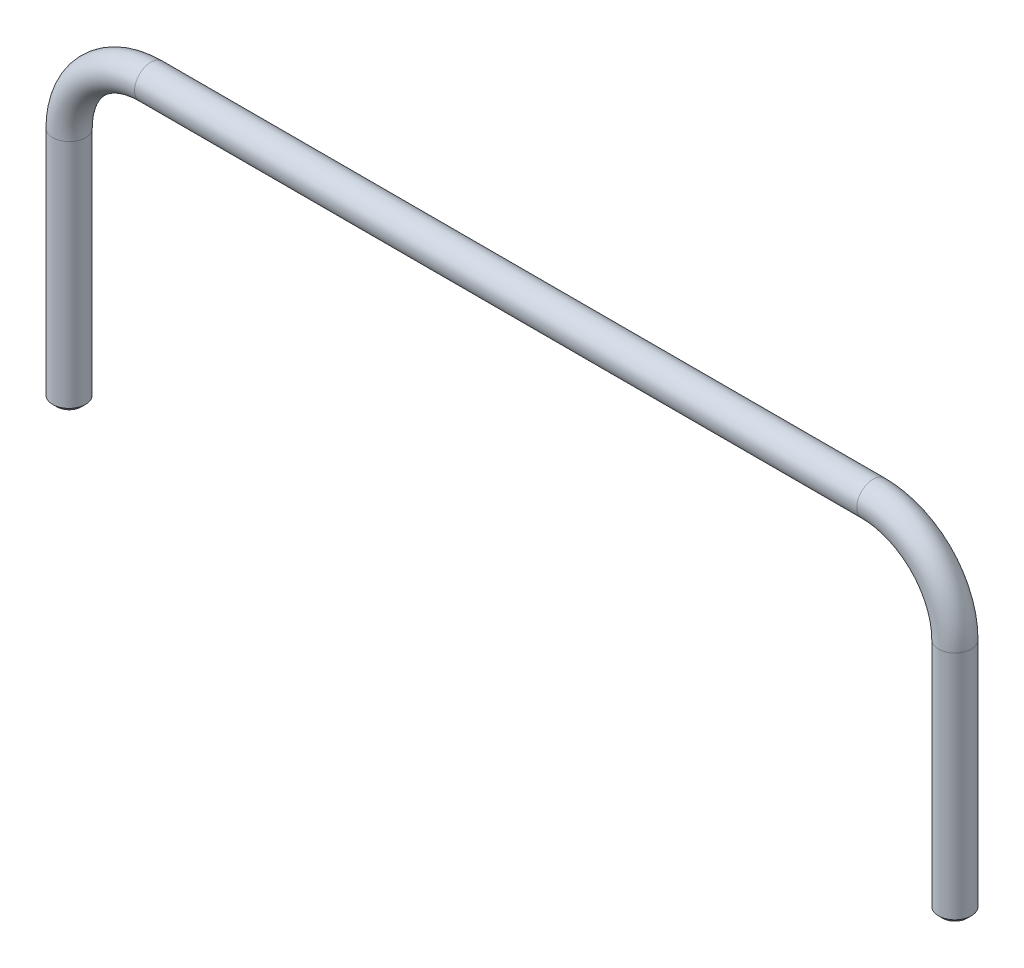
ISO-10303-21;
HEADER;
FILE_DESCRIPTION(('STEP AP214'),'2;1');
FILE_NAME('part.step','',(''),(''),'','','');
FILE_SCHEMA(('AUTOMOTIVE_DESIGN { 1 0 10303 214 1 1 1 1 }'));
ENDSEC;
DATA;
#1=APPLICATION_CONTEXT('core data for automotive mechanical design processes');
#2=APPLICATION_PROTOCOL_DEFINITION('international standard','automotive_design',2000,#1);
#3=PRODUCT_CONTEXT('',#1,'mechanical');
#4=PRODUCT('Part','Part','',(#3));
#5=PRODUCT_RELATED_PRODUCT_CATEGORY('part','',(#4));
#6=PRODUCT_DEFINITION_FORMATION('','',#4);
#7=PRODUCT_DEFINITION_CONTEXT('part definition',#1,'design');
#8=PRODUCT_DEFINITION('design','',#6,#7);
#9=PRODUCT_DEFINITION_SHAPE('','',#8);
#10=(LENGTH_UNIT() NAMED_UNIT(*) SI_UNIT(.MILLI.,.METRE.));
#11=(NAMED_UNIT(*) PLANE_ANGLE_UNIT() SI_UNIT($,.RADIAN.));
#12=(NAMED_UNIT(*) SI_UNIT($,.STERADIAN.) SOLID_ANGLE_UNIT());
#13=UNCERTAINTY_MEASURE_WITH_UNIT(LENGTH_MEASURE(1.E-05),#10,'distance_accuracy_value','');
#14=(GEOMETRIC_REPRESENTATION_CONTEXT(3) GLOBAL_UNCERTAINTY_ASSIGNED_CONTEXT((#13)) GLOBAL_UNIT_ASSIGNED_CONTEXT((#10,
#11,#12)) REPRESENTATION_CONTEXT('',''));
#15=CARTESIAN_POINT('',(0.,0.,0.));
#16=DIRECTION('',(0.,0.,1.));
#17=DIRECTION('',(1.,0.,0.));
#18=AXIS2_PLACEMENT_3D('',#15,#16,#17);
#19=CARTESIAN_POINT('',(0.,11.75,0.));
#20=DIRECTION('',(-1.,0.,0.));
#21=DIRECTION('',(0.,-1.,0.));
#22=AXIS2_PLACEMENT_3D('',#19,#20,#21);
#23=CYLINDRICAL_SURFACE('',#22,0.4);
#24=CARTESIAN_POINT('',(8.83,11.75,0.));
#25=DIRECTION('',(-1.,0.,0.));
#26=DIRECTION('',(0.,-1.,0.));
#27=AXIS2_PLACEMENT_3D('',#24,#25,#26);
#28=CIRCLE('',#27,0.4);
#29=CARTESIAN_POINT('',(8.83,12.15,0.));
#30=VERTEX_POINT('',#29);
#31=EDGE_CURVE('E141',#30,#30,#28,.T.);
#32=ORIENTED_EDGE('',*,*,#31,.T.);
#33=CARTESIAN_POINT('',(8.83,12.15,0.));
#34=CARTESIAN_POINT('',(-8.83,12.15,0.));
#35=(BOUNDED_CURVE() B_SPLINE_CURVE(1,(#33,#34),.UNSPECIFIED.,.F.,
.F.) B_SPLINE_CURVE_WITH_KNOTS((2,2),(-8.83,8.83),
.UNSPECIFIED.) CURVE() GEOMETRIC_REPRESENTATION_ITEM() RATIONAL_B_SPLINE_CURVE((1.,1.)) REPRESENTATION_ITEM(''));
#36=CARTESIAN_POINT('',(-8.83,12.15,0.));
#37=VERTEX_POINT('',#36);
#38=EDGE_CURVE('E11',#30,#37,#35,.T.);
#39=ORIENTED_EDGE('',*,*,#38,.T.);
#40=CARTESIAN_POINT('',(-8.83,11.75,0.));
#41=DIRECTION('',(-1.,0.,0.));
#42=DIRECTION('',(0.,-1.,0.));
#43=AXIS2_PLACEMENT_3D('',#40,#41,#42);
#44=CIRCLE('',#43,0.4);
#45=EDGE_CURVE('E28',#37,#37,#44,.T.);
#46=ORIENTED_EDGE('',*,*,#45,.F.);
#47=ORIENTED_EDGE('',*,*,#38,.F.);
#48=EDGE_LOOP('',(#32,#39,#46,#47));
#49=FACE_BOUND('',#48,.T.);
#50=ADVANCED_FACE('F17',(#49),#23,.T.);
#51=CARTESIAN_POINT('',(-8.83,9.75,0.));
#52=DIRECTION('',(0.,0.,1.));
#53=DIRECTION('',(1.,0.,0.));
#54=AXIS2_PLACEMENT_3D('',#51,#52,#53);
#55=TOROIDAL_SURFACE('',#54,2.,0.4);
#56=CARTESIAN_POINT('',(-10.83,9.75,0.));
#57=DIRECTION('',(0.,-1.,0.));
#58=DIRECTION('',(1.,0.,0.));
#59=AXIS2_PLACEMENT_3D('',#56,#57,#58);
#60=CIRCLE('',#59,0.4);
#61=CARTESIAN_POINT('',(-11.23,9.75,0.));
#62=VERTEX_POINT('',#61);
#63=EDGE_CURVE('E128',#62,#62,#60,.T.);
#64=ORIENTED_EDGE('',*,*,#63,.F.);
#65=CARTESIAN_POINT('',(-8.83,12.15,0.));
#66=CARTESIAN_POINT('',(-9.458318530718,12.15,0.));
#67=CARTESIAN_POINT('',(-10.08658360169,11.952653553551,0.));
#68=CARTESIAN_POINT('',(-10.63765635913,11.557656359136,0.));
#69=CARTESIAN_POINT('',(-11.03265355355,11.006583601692,0.));
#70=CARTESIAN_POINT('',(-11.23,10.378318530718,0.));
#71=CARTESIAN_POINT('',(-11.23,9.75,0.));
#72=(BOUNDED_CURVE() B_SPLINE_CURVE(6,(#65,#66,#67,#68,#69,#70,#71),.UNSPECIFIED.,.F.,
.F.) B_SPLINE_CURVE_WITH_KNOTS((7,7),(1.570796326795,3.14159265359),
.UNSPECIFIED.) CURVE() GEOMETRIC_REPRESENTATION_ITEM() RATIONAL_B_SPLINE_CURVE((1.,1.,1.,1.,1.,
1.,1.)) REPRESENTATION_ITEM(''));
#73=EDGE_CURVE('E59',#37,#62,#72,.T.);
#74=ORIENTED_EDGE('',*,*,#73,.F.);
#75=ORIENTED_EDGE('',*,*,#45,.T.);
#76=ORIENTED_EDGE('',*,*,#73,.T.);
#77=EDGE_LOOP('',(#64,#74,#75,#76));
#78=FACE_BOUND('',#77,.T.);
#79=ADVANCED_FACE('F165',(#78),#55,.T.);
#80=CARTESIAN_POINT('',(8.83,9.75,0.));
#81=DIRECTION('',(0.,0.,1.));
#82=DIRECTION('',(-1.,0.,0.));
#83=AXIS2_PLACEMENT_3D('',#80,#81,#82);
#84=TOROIDAL_SURFACE('',#83,2.,0.4);
#85=CARTESIAN_POINT('',(10.83,9.75,0.));
#86=DIRECTION('',(0.,1.,0.));
#87=DIRECTION('',(-1.,0.,0.));
#88=AXIS2_PLACEMENT_3D('',#85,#86,#87);
#89=CIRCLE('',#88,0.4);
#90=CARTESIAN_POINT('',(11.23,9.75,0.));
#91=VERTEX_POINT('',#90);
#92=EDGE_CURVE('E97',#91,#91,#89,.T.);
#93=ORIENTED_EDGE('',*,*,#92,.T.);
#94=CARTESIAN_POINT('',(11.23,9.75,0.));
#95=CARTESIAN_POINT('',(11.23,10.378318530718,0.));
#96=CARTESIAN_POINT('',(11.032653553551,11.006583601692,0.));
#97=CARTESIAN_POINT('',(10.637656359137,11.557656359137,0.));
#98=CARTESIAN_POINT('',(10.086583601692,11.952653553551,0.));
#99=CARTESIAN_POINT('',(9.458318530718,12.15,0.));
#100=CARTESIAN_POINT('',(8.83,12.15,0.));
#101=(BOUNDED_CURVE() B_SPLINE_CURVE(6,(#94,#95,#96,#97,#98,#99,#100),.UNSPECIFIED.,.F.,
.F.) B_SPLINE_CURVE_WITH_KNOTS((7,7),(3.14159265359,4.712388980385),
.UNSPECIFIED.) CURVE() GEOMETRIC_REPRESENTATION_ITEM() RATIONAL_B_SPLINE_CURVE((1.,1.,1.,1.,1.,
1.,1.)) REPRESENTATION_ITEM(''));
#102=EDGE_CURVE('E83',#91,#30,#101,.T.);
#103=ORIENTED_EDGE('',*,*,#102,.T.);
#104=ORIENTED_EDGE('',*,*,#31,.F.);
#105=ORIENTED_EDGE('',*,*,#102,.F.);
#106=EDGE_LOOP('',(#93,#103,#104,#105));
#107=FACE_BOUND('',#106,.T.);
#108=ADVANCED_FACE('F162',(#107),#84,.T.);
#109=CARTESIAN_POINT('',(-10.83,9.75,0.));
#110=DIRECTION('',(0.,-1.,0.));
#111=DIRECTION('',(1.,0.,0.));
#112=AXIS2_PLACEMENT_3D('',#109,#110,#111);
#113=CYLINDRICAL_SURFACE('',#112,0.4);
#114=ORIENTED_EDGE('',*,*,#63,.T.);
#115=CARTESIAN_POINT('',(-11.23,9.75,0.));
#116=CARTESIAN_POINT('',(-11.23,4.1,0.));
#117=(BOUNDED_CURVE() B_SPLINE_CURVE(1,(#115,#116),.UNSPECIFIED.,.F.,
.F.) B_SPLINE_CURVE_WITH_KNOTS((2,2),(0.,5.65),
.UNSPECIFIED.) CURVE() GEOMETRIC_REPRESENTATION_ITEM() RATIONAL_B_SPLINE_CURVE((1.,1.)) REPRESENTATION_ITEM(''));
#118=CARTESIAN_POINT('',(-11.23,4.1,0.));
#119=VERTEX_POINT('',#118);
#120=EDGE_CURVE('E67',#62,#119,#117,.T.);
#121=ORIENTED_EDGE('',*,*,#120,.T.);
#122=CARTESIAN_POINT('',(-10.83,4.1,0.));
#123=DIRECTION('',(0.,-1.,0.));
#124=DIRECTION('',(1.,0.,0.));
#125=AXIS2_PLACEMENT_3D('',#122,#123,#124);
#126=CIRCLE('',#125,0.4);
#127=EDGE_CURVE('E130',#119,#119,#126,.T.);
#128=ORIENTED_EDGE('',*,*,#127,.F.);
#129=ORIENTED_EDGE('',*,*,#120,.F.);
#130=EDGE_LOOP('',(#114,#121,#128,#129));
#131=FACE_BOUND('',#130,.T.);
#132=ADVANCED_FACE('F235',(#131),#113,.T.);
#133=CARTESIAN_POINT('',(-15.5235922651,4.,0.));
#134=DIRECTION('',(0.,1.,0.));
#135=DIRECTION('',(1.,0.,0.));
#136=AXIS2_PLACEMENT_3D('',#133,#134,#135);
#137=PLANE('',#136);
#138=CARTESIAN_POINT('',(-10.83,4.,0.));
#139=DIRECTION('',(0.,1.,0.));
#140=DIRECTION('',(1.,0.,0.));
#141=AXIS2_PLACEMENT_3D('',#138,#139,#140);
#142=CIRCLE('',#141,0.3);
#143=CARTESIAN_POINT('',(-11.13,4.,0.));
#144=VERTEX_POINT('',#143);
#145=EDGE_CURVE('E99',#144,#144,#142,.T.);
#146=ORIENTED_EDGE('',*,*,#145,.F.);
#147=EDGE_LOOP('',(#146));
#148=FACE_BOUND('',#147,.T.);
#149=ADVANCED_FACE('F240',(#148),#137,.F.);
#150=CARTESIAN_POINT('',(-10.83,4.05,0.));
#151=DIRECTION('',(0.,1.,0.));
#152=DIRECTION('',(1.,0.,0.));
#153=AXIS2_PLACEMENT_3D('',#150,#151,#152);
#154=CONICAL_SURFACE('',#153,0.35,0.7853981634);
#155=ORIENTED_EDGE('',*,*,#145,.T.);
#156=CARTESIAN_POINT('',(-11.13,4.,0.));
#157=CARTESIAN_POINT('',(-11.23,4.1,0.));
#158=(BOUNDED_CURVE() B_SPLINE_CURVE(1,(#156,#157),.UNSPECIFIED.,.F.,
.F.) B_SPLINE_CURVE_WITH_KNOTS((2,2),(-0.07071067811865,0.07071067811866),
.UNSPECIFIED.) CURVE() GEOMETRIC_REPRESENTATION_ITEM() RATIONAL_B_SPLINE_CURVE((1.,1.)) REPRESENTATION_ITEM(''));
#159=EDGE_CURVE('E76',#144,#119,#158,.T.);
#160=ORIENTED_EDGE('',*,*,#159,.T.);
#161=ORIENTED_EDGE('',*,*,#127,.T.);
#162=ORIENTED_EDGE('',*,*,#159,.F.);
#163=EDGE_LOOP('',(#155,#160,#161,#162));
#164=FACE_BOUND('',#163,.T.);
#165=ADVANCED_FACE('F19',(#164),#154,.T.);
#166=CARTESIAN_POINT('',(10.83,9.75,0.));
#167=DIRECTION('',(0.,1.,0.));
#168=DIRECTION('',(-1.,0.,0.));
#169=AXIS2_PLACEMENT_3D('',#166,#167,#168);
#170=CYLINDRICAL_SURFACE('',#169,0.4);
#171=ORIENTED_EDGE('',*,*,#92,.F.);
#172=CARTESIAN_POINT('',(11.23,4.1,0.));
#173=CARTESIAN_POINT('',(11.23,9.75,0.));
#174=(BOUNDED_CURVE() B_SPLINE_CURVE(1,(#172,#173),.UNSPECIFIED.,.F.,
.F.) B_SPLINE_CURVE_WITH_KNOTS((2,2),(-5.65,0.),
.UNSPECIFIED.) CURVE() GEOMETRIC_REPRESENTATION_ITEM() RATIONAL_B_SPLINE_CURVE((1.,1.)) REPRESENTATION_ITEM(''));
#175=CARTESIAN_POINT('',(11.23,4.1,0.));
#176=VERTEX_POINT('',#175);
#177=EDGE_CURVE('E93',#176,#91,#174,.T.);
#178=ORIENTED_EDGE('',*,*,#177,.F.);
#179=CARTESIAN_POINT('',(10.83,4.1,0.));
#180=DIRECTION('',(0.,-1.,0.));
#181=DIRECTION('',(-1.,0.,0.));
#182=AXIS2_PLACEMENT_3D('',#179,#180,#181);
#183=CIRCLE('',#182,0.4);
#184=EDGE_CURVE('E21',#176,#176,#183,.T.);
#185=ORIENTED_EDGE('',*,*,#184,.F.);
#186=ORIENTED_EDGE('',*,*,#177,.T.);
#187=EDGE_LOOP('',(#171,#178,#185,#186));
#188=FACE_BOUND('',#187,.T.);
#189=ADVANCED_FACE('F95',(#188),#170,.T.);
#190=CARTESIAN_POINT('',(-15.5235922651,4.,0.));
#191=DIRECTION('',(0.,1.,0.));
#192=DIRECTION('',(1.,0.,0.));
#193=AXIS2_PLACEMENT_3D('',#190,#191,#192);
#194=PLANE('',#193);
#195=CARTESIAN_POINT('',(10.83,4.,0.));
#196=DIRECTION('',(0.,1.,0.));
#197=DIRECTION('',(-1.,0.,0.));
#198=AXIS2_PLACEMENT_3D('',#195,#196,#197);
#199=CIRCLE('',#198,0.3);
#200=CARTESIAN_POINT('',(11.13,4.,0.));
#201=VERTEX_POINT('',#200);
#202=EDGE_CURVE('E112',#201,#201,#199,.T.);
#203=ORIENTED_EDGE('',*,*,#202,.F.);
#204=EDGE_LOOP('',(#203));
#205=FACE_BOUND('',#204,.T.);
#206=ADVANCED_FACE('F214',(#205),#194,.F.);
#207=CARTESIAN_POINT('',(10.83,4.05,0.));
#208=DIRECTION('',(0.,1.,0.));
#209=DIRECTION('',(-1.,0.,0.));
#210=AXIS2_PLACEMENT_3D('',#207,#208,#209);
#211=CONICAL_SURFACE('',#210,0.35,0.7853981634);
#212=ORIENTED_EDGE('',*,*,#202,.T.);
#213=CARTESIAN_POINT('',(11.13,4.,0.));
#214=CARTESIAN_POINT('',(11.23,4.1,0.));
#215=(BOUNDED_CURVE() B_SPLINE_CURVE(1,(#213,#214),.UNSPECIFIED.,.F.,
.F.) B_SPLINE_CURVE_WITH_KNOTS((2,2),(-0.07071067811863,0.07071067811863),
.UNSPECIFIED.) CURVE() GEOMETRIC_REPRESENTATION_ITEM() RATIONAL_B_SPLINE_CURVE((1.,1.)) REPRESENTATION_ITEM(''));
#216=EDGE_CURVE('E104',#201,#176,#215,.T.);
#217=ORIENTED_EDGE('',*,*,#216,.T.);
#218=ORIENTED_EDGE('',*,*,#184,.T.);
#219=ORIENTED_EDGE('',*,*,#216,.F.);
#220=EDGE_LOOP('',(#212,#217,#218,#219));
#221=FACE_BOUND('',#220,.T.);
#222=ADVANCED_FACE('F103',(#221),#211,.T.);
#223=CLOSED_SHELL('',(#50,#79,#108,#132,#149,#165,#189,#206,#222));
#224=MANIFOLD_SOLID_BREP('B1',#223);
#225=ADVANCED_BREP_SHAPE_REPRESENTATION('',(#18,#224),#14);
#226=SHAPE_DEFINITION_REPRESENTATION(#9,#225);
ENDSEC;
END-ISO-10303-21;
